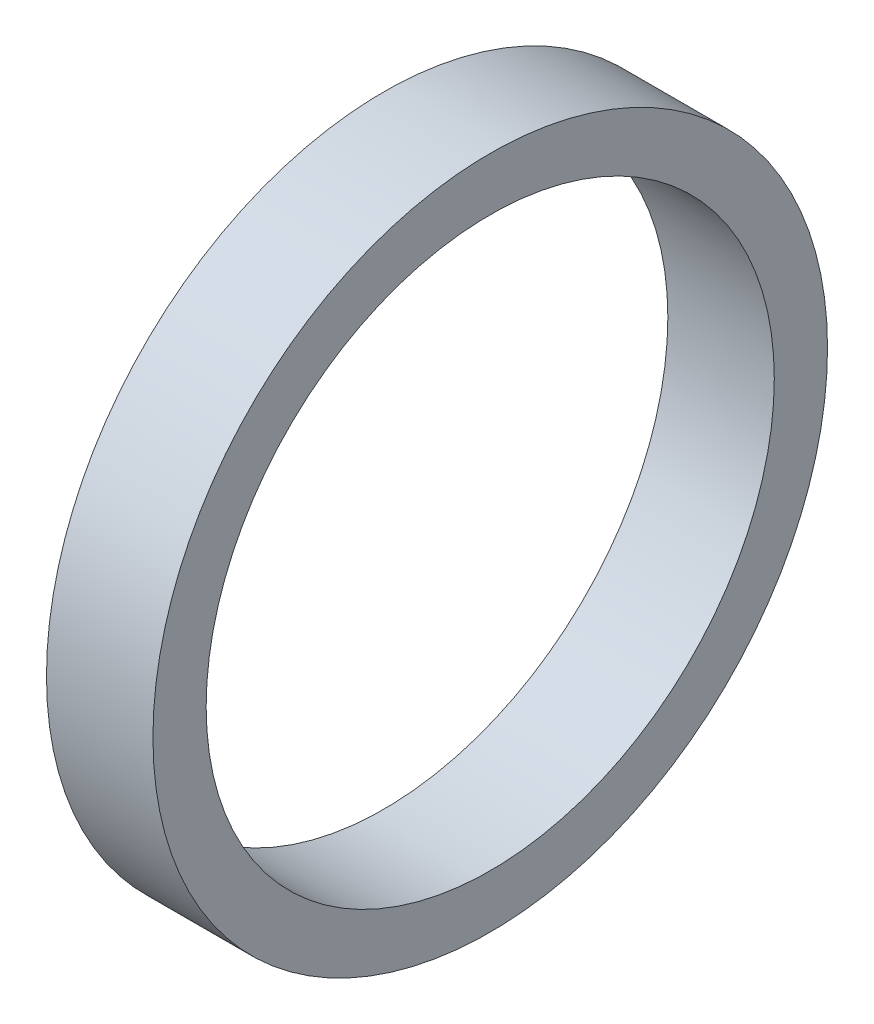
ISO-10303-21;
HEADER;
FILE_DESCRIPTION(('STEP AP214'),'2;1');
FILE_NAME('part.step','',(''),(''),'','','');
FILE_SCHEMA(('AUTOMOTIVE_DESIGN { 1 0 10303 214 1 1 1 1 }'));
ENDSEC;
DATA;
#1=APPLICATION_CONTEXT('core data for automotive mechanical design processes');
#2=APPLICATION_PROTOCOL_DEFINITION('international standard','automotive_design',2000,#1);
#3=PRODUCT_CONTEXT('',#1,'mechanical');
#4=PRODUCT('Part','Part','',(#3));
#5=PRODUCT_RELATED_PRODUCT_CATEGORY('part','',(#4));
#6=PRODUCT_DEFINITION_FORMATION('','',#4);
#7=PRODUCT_DEFINITION_CONTEXT('part definition',#1,'design');
#8=PRODUCT_DEFINITION('design','',#6,#7);
#9=PRODUCT_DEFINITION_SHAPE('','',#8);
#10=(LENGTH_UNIT() NAMED_UNIT(*) SI_UNIT(.MILLI.,.METRE.));
#11=(NAMED_UNIT(*) PLANE_ANGLE_UNIT() SI_UNIT($,.RADIAN.));
#12=(NAMED_UNIT(*) SI_UNIT($,.STERADIAN.) SOLID_ANGLE_UNIT());
#13=UNCERTAINTY_MEASURE_WITH_UNIT(LENGTH_MEASURE(1.E-05),#10,'distance_accuracy_value','');
#14=(GEOMETRIC_REPRESENTATION_CONTEXT(3) GLOBAL_UNCERTAINTY_ASSIGNED_CONTEXT((#13)) GLOBAL_UNIT_ASSIGNED_CONTEXT((#10,
#11,#12)) REPRESENTATION_CONTEXT('',''));
#15=CARTESIAN_POINT('',(0.,0.,0.));
#16=DIRECTION('',(0.,0.,1.));
#17=DIRECTION('',(1.,0.,0.));
#18=AXIS2_PLACEMENT_3D('',#15,#16,#17);
#19=CARTESIAN_POINT('',(0.,0.,-12.675));
#20=DIRECTION('',(-1.,0.,0.));
#21=DIRECTION('',(0.,0.,1.));
#22=AXIS2_PLACEMENT_3D('',#19,#20,#21);
#23=PLANE('',#22);
#24=CARTESIAN_POINT('',(0.,0.,0.));
#25=DIRECTION('',(-1.,0.,0.));
#26=DIRECTION('',(0.,0.,1.));
#27=AXIS2_PLACEMENT_3D('',#24,#25,#26);
#28=CIRCLE('',#27,12.675);
#29=CARTESIAN_POINT('',(0.,0.,12.675));
#30=VERTEX_POINT('',#29);
#31=EDGE_CURVE('E44',#30,#30,#28,.T.);
#32=ORIENTED_EDGE('',*,*,#31,.F.);
#33=EDGE_LOOP('',(#32));
#34=FACE_BOUND('',#33,.T.);
#35=CARTESIAN_POINT('',(0.,0.,0.));
#36=DIRECTION('',(-1.,0.,0.));
#37=DIRECTION('',(0.,0.,1.));
#38=AXIS2_PLACEMENT_3D('',#35,#36,#37);
#39=CIRCLE('',#38,10.675);
#40=CARTESIAN_POINT('',(0.,0.,10.675));
#41=VERTEX_POINT('',#40);
#42=EDGE_CURVE('E10',#41,#41,#39,.T.);
#43=ORIENTED_EDGE('',*,*,#42,.T.);
#44=EDGE_LOOP('',(#43));
#45=FACE_BOUND('',#44,.T.);
#46=ADVANCED_FACE('F30',(#34,#45),#23,.F.);
#47=CARTESIAN_POINT('',(-20.7850910557861,0.,0.));
#48=DIRECTION('',(-1.,0.,0.));
#49=DIRECTION('',(0.,0.,1.));
#50=AXIS2_PLACEMENT_3D('',#47,#48,#49);
#51=CYLINDRICAL_SURFACE('',#50,10.675);
#52=ORIENTED_EDGE('',*,*,#42,.F.);
#53=EDGE_LOOP('',(#52));
#54=FACE_BOUND('',#53,.T.);
#55=CARTESIAN_POINT('',(-4.,0.,0.));
#56=DIRECTION('',(-1.,0.,0.));
#57=DIRECTION('',(0.,0.,1.));
#58=AXIS2_PLACEMENT_3D('',#55,#56,#57);
#59=CIRCLE('',#58,10.675);
#60=CARTESIAN_POINT('',(-3.99999999999999,0.,10.675));
#61=VERTEX_POINT('',#60);
#62=EDGE_CURVE('E36',#61,#61,#59,.T.);
#63=ORIENTED_EDGE('',*,*,#62,.T.);
#64=EDGE_LOOP('',(#63));
#65=FACE_BOUND('',#64,.T.);
#66=ADVANCED_FACE('F53',(#54,#65),#51,.F.);
#67=CARTESIAN_POINT('',(-4.,0.,-10.675));
#68=DIRECTION('',(1.,0.,0.));
#69=DIRECTION('',(0.,0.,-1.));
#70=AXIS2_PLACEMENT_3D('',#67,#68,#69);
#71=PLANE('',#70);
#72=ORIENTED_EDGE('',*,*,#62,.F.);
#73=EDGE_LOOP('',(#72));
#74=FACE_BOUND('',#73,.T.);
#75=CARTESIAN_POINT('',(-4.,0.,0.));
#76=DIRECTION('',(-1.,0.,0.));
#77=DIRECTION('',(0.,0.,1.));
#78=AXIS2_PLACEMENT_3D('',#75,#76,#77);
#79=CIRCLE('',#78,12.675);
#80=CARTESIAN_POINT('',(-3.99999999999999,0.,12.675));
#81=VERTEX_POINT('',#80);
#82=EDGE_CURVE('E40',#81,#81,#79,.T.);
#83=ORIENTED_EDGE('',*,*,#82,.T.);
#84=EDGE_LOOP('',(#83));
#85=FACE_BOUND('',#84,.T.);
#86=ADVANCED_FACE('F57',(#74,#85),#71,.F.);
#87=CARTESIAN_POINT('',(-20.7850910557861,0.,0.));
#88=DIRECTION('',(-1.,0.,0.));
#89=DIRECTION('',(0.,0.,1.));
#90=AXIS2_PLACEMENT_3D('',#87,#88,#89);
#91=CYLINDRICAL_SURFACE('',#90,12.675);
#92=ORIENTED_EDGE('',*,*,#82,.F.);
#93=EDGE_LOOP('',(#92));
#94=FACE_BOUND('',#93,.T.);
#95=ORIENTED_EDGE('',*,*,#31,.T.);
#96=EDGE_LOOP('',(#95));
#97=FACE_BOUND('',#96,.T.);
#98=ADVANCED_FACE('F50',(#94,#97),#91,.T.);
#99=CLOSED_SHELL('',(#46,#66,#86,#98));
#100=MANIFOLD_SOLID_BREP('B2',#99);
#101=ADVANCED_BREP_SHAPE_REPRESENTATION('',(#18,#100),#14);
#102=SHAPE_DEFINITION_REPRESENTATION(#9,#101);
ENDSEC;
END-ISO-10303-21;
